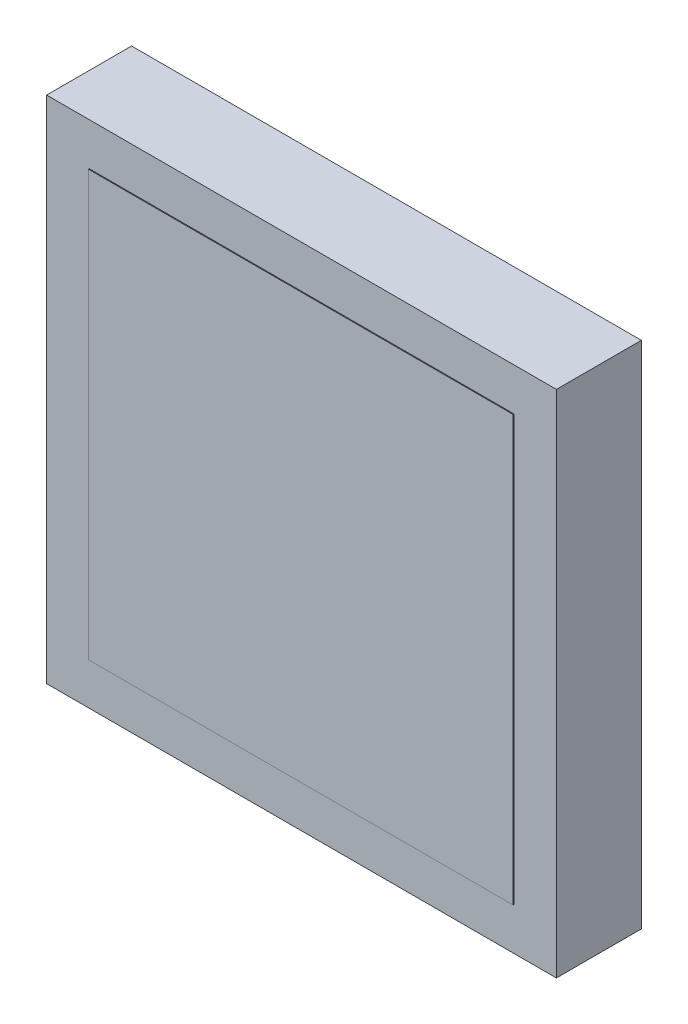
ISO-10303-21;
HEADER;
FILE_DESCRIPTION(('STEP AP214'),'2;1');
FILE_NAME('part.step','',(''),(''),'','','');
FILE_SCHEMA(('AUTOMOTIVE_DESIGN { 1 0 10303 214 1 1 1 1 }'));
ENDSEC;
DATA;
#1=APPLICATION_CONTEXT('core data for automotive mechanical design processes');
#2=APPLICATION_PROTOCOL_DEFINITION('international standard','automotive_design',2000,#1);
#3=PRODUCT_CONTEXT('',#1,'mechanical');
#4=PRODUCT('Part','Part','',(#3));
#5=PRODUCT_RELATED_PRODUCT_CATEGORY('part','',(#4));
#6=PRODUCT_DEFINITION_FORMATION('','',#4);
#7=PRODUCT_DEFINITION_CONTEXT('part definition',#1,'design');
#8=PRODUCT_DEFINITION('design','',#6,#7);
#9=PRODUCT_DEFINITION_SHAPE('','',#8);
#10=(LENGTH_UNIT() NAMED_UNIT(*) SI_UNIT(.MILLI.,.METRE.));
#11=(NAMED_UNIT(*) PLANE_ANGLE_UNIT() SI_UNIT($,.RADIAN.));
#12=(NAMED_UNIT(*) SI_UNIT($,.STERADIAN.) SOLID_ANGLE_UNIT());
#13=UNCERTAINTY_MEASURE_WITH_UNIT(LENGTH_MEASURE(1.E-05),#10,'distance_accuracy_value','');
#14=(GEOMETRIC_REPRESENTATION_CONTEXT(3) GLOBAL_UNCERTAINTY_ASSIGNED_CONTEXT((#13)) GLOBAL_UNIT_ASSIGNED_CONTEXT((#10,
#11,#12)) REPRESENTATION_CONTEXT('',''));
#15=CARTESIAN_POINT('',(0.,0.,0.));
#16=DIRECTION('',(0.,0.,1.));
#17=DIRECTION('',(1.,0.,0.));
#18=AXIS2_PLACEMENT_3D('',#15,#16,#17);
#19=CARTESIAN_POINT('',(0.,0.,10.));
#20=DIRECTION('',(0.,0.,-1.));
#21=DIRECTION('',(-1.,0.,0.));
#22=AXIS2_PLACEMENT_3D('',#19,#20,#21);
#23=PLANE('',#22);
#24=DIRECTION('',(0.,1.,0.));
#25=VECTOR('',#24,1.);
#26=CARTESIAN_POINT('',(30.,-30.,10.));
#27=LINE('',#26,#25);
#28=CARTESIAN_POINT('',(30.,-30.,10.));
#29=VERTEX_POINT('',#28);
#30=CARTESIAN_POINT('',(30.,30.,10.));
#31=VERTEX_POINT('',#30);
#32=EDGE_CURVE('E127',#29,#31,#27,.T.);
#33=ORIENTED_EDGE('',*,*,#32,.T.);
#34=DIRECTION('',(-1.,0.,0.));
#35=VECTOR('',#34,1.);
#36=CARTESIAN_POINT('',(-30.,30.,10.));
#37=LINE('',#36,#35);
#38=CARTESIAN_POINT('',(-30.,30.,10.));
#39=VERTEX_POINT('',#38);
#40=EDGE_CURVE('E130',#31,#39,#37,.T.);
#41=ORIENTED_EDGE('',*,*,#40,.T.);
#42=DIRECTION('',(0.,-1.,0.));
#43=VECTOR('',#42,1.);
#44=CARTESIAN_POINT('',(-30.,-30.,10.));
#45=LINE('',#44,#43);
#46=CARTESIAN_POINT('',(-30.,-30.,10.));
#47=VERTEX_POINT('',#46);
#48=EDGE_CURVE('E133',#39,#47,#45,.T.);
#49=ORIENTED_EDGE('',*,*,#48,.T.);
#50=DIRECTION('',(1.,0.,0.));
#51=VECTOR('',#50,1.);
#52=CARTESIAN_POINT('',(-30.,-30.,10.));
#53=LINE('',#52,#51);
#54=EDGE_CURVE('E135',#47,#29,#53,.T.);
#55=ORIENTED_EDGE('',*,*,#54,.T.);
#56=EDGE_LOOP('',(#33,#41,#49,#55));
#57=FACE_BOUND('',#56,.T.);
#58=DIRECTION('',(0.,1.,0.));
#59=VECTOR('',#58,1.);
#60=CARTESIAN_POINT('',(25.,-25.,10.));
#61=LINE('',#60,#59);
#62=CARTESIAN_POINT('',(25.,-25.,10.));
#63=VERTEX_POINT('',#62);
#64=CARTESIAN_POINT('',(25.,25.,10.));
#65=VERTEX_POINT('',#64);
#66=EDGE_CURVE('E48',#63,#65,#61,.T.);
#67=ORIENTED_EDGE('',*,*,#66,.F.);
#68=DIRECTION('',(1.,0.,0.));
#69=VECTOR('',#68,1.);
#70=CARTESIAN_POINT('',(-25.,-25.,10.));
#71=LINE('',#70,#69);
#72=CARTESIAN_POINT('',(-25.,-25.,10.));
#73=VERTEX_POINT('',#72);
#74=EDGE_CURVE('E52',#73,#63,#71,.T.);
#75=ORIENTED_EDGE('',*,*,#74,.F.);
#76=DIRECTION('',(0.,-1.,0.));
#77=VECTOR('',#76,1.);
#78=CARTESIAN_POINT('',(-25.,-25.,10.));
#79=LINE('',#78,#77);
#80=CARTESIAN_POINT('',(-25.,25.,10.));
#81=VERTEX_POINT('',#80);
#82=EDGE_CURVE('E260',#81,#73,#79,.T.);
#83=ORIENTED_EDGE('',*,*,#82,.F.);
#84=DIRECTION('',(-1.,0.,0.));
#85=VECTOR('',#84,1.);
#86=CARTESIAN_POINT('',(-25.,25.,10.));
#87=LINE('',#86,#85);
#88=EDGE_CURVE('E266',#65,#81,#87,.T.);
#89=ORIENTED_EDGE('',*,*,#88,.F.);
#90=EDGE_LOOP('',(#67,#75,#83,#89));
#91=FACE_BOUND('',#90,.T.);
#92=ADVANCED_FACE('F33',(#57,#91),#23,.F.);
#93=CARTESIAN_POINT('',(30.,-30.,10.));
#94=DIRECTION('',(-1.,0.,0.));
#95=DIRECTION('',(0.,0.,1.));
#96=AXIS2_PLACEMENT_3D('',#93,#94,#95);
#97=PLANE('',#96);
#98=DIRECTION('',(0.,1.,0.));
#99=VECTOR('',#98,1.);
#100=CARTESIAN_POINT('',(30.,-30.,0.));
#101=LINE('',#100,#99);
#102=CARTESIAN_POINT('',(30.,-30.,0.));
#103=VERTEX_POINT('',#102);
#104=CARTESIAN_POINT('',(30.,30.,0.));
#105=VERTEX_POINT('',#104);
#106=EDGE_CURVE('E118',#103,#105,#101,.T.);
#107=ORIENTED_EDGE('',*,*,#106,.T.);
#108=DIRECTION('',(0.,0.,-1.));
#109=VECTOR('',#108,1.);
#110=CARTESIAN_POINT('',(30.,30.,10.));
#111=LINE('',#110,#109);
#112=EDGE_CURVE('E11',#31,#105,#111,.T.);
#113=ORIENTED_EDGE('',*,*,#112,.F.);
#114=ORIENTED_EDGE('',*,*,#32,.F.);
#115=DIRECTION('',(0.,0.,-1.));
#116=VECTOR('',#115,1.);
#117=CARTESIAN_POINT('',(30.,-30.,10.));
#118=LINE('',#117,#116);
#119=EDGE_CURVE('E136',#29,#103,#118,.T.);
#120=ORIENTED_EDGE('',*,*,#119,.T.);
#121=EDGE_LOOP('',(#107,#113,#114,#120));
#122=FACE_BOUND('',#121,.T.);
#123=ADVANCED_FACE('F35',(#122),#97,.F.);
#124=CARTESIAN_POINT('',(-30.,30.,10.));
#125=DIRECTION('',(0.,-1.,0.));
#126=DIRECTION('',(0.,0.,-1.));
#127=AXIS2_PLACEMENT_3D('',#124,#125,#126);
#128=PLANE('',#127);
#129=DIRECTION('',(-1.,0.,0.));
#130=VECTOR('',#129,1.);
#131=CARTESIAN_POINT('',(-30.,30.,0.));
#132=LINE('',#131,#130);
#133=CARTESIAN_POINT('',(-30.,30.,0.));
#134=VERTEX_POINT('',#133);
#135=EDGE_CURVE('E121',#105,#134,#132,.T.);
#136=ORIENTED_EDGE('',*,*,#135,.T.);
#137=DIRECTION('',(0.,0.,-1.));
#138=VECTOR('',#137,1.);
#139=CARTESIAN_POINT('',(-30.,30.,10.));
#140=LINE('',#139,#138);
#141=EDGE_CURVE('E41',#39,#134,#140,.T.);
#142=ORIENTED_EDGE('',*,*,#141,.F.);
#143=ORIENTED_EDGE('',*,*,#40,.F.);
#144=ORIENTED_EDGE('',*,*,#112,.T.);
#145=EDGE_LOOP('',(#136,#142,#143,#144));
#146=FACE_BOUND('',#145,.T.);
#147=ADVANCED_FACE('F166',(#146),#128,.F.);
#148=CARTESIAN_POINT('',(-30.,-30.,10.));
#149=DIRECTION('',(1.,0.,0.));
#150=DIRECTION('',(0.,0.,-1.));
#151=AXIS2_PLACEMENT_3D('',#148,#149,#150);
#152=PLANE('',#151);
#153=DIRECTION('',(0.,-1.,0.));
#154=VECTOR('',#153,1.);
#155=CARTESIAN_POINT('',(-30.,-30.,0.));
#156=LINE('',#155,#154);
#157=CARTESIAN_POINT('',(-30.,-30.,0.));
#158=VERTEX_POINT('',#157);
#159=EDGE_CURVE('E139',#134,#158,#156,.T.);
#160=ORIENTED_EDGE('',*,*,#159,.T.);
#161=DIRECTION('',(0.,0.,-1.));
#162=VECTOR('',#161,1.);
#163=CARTESIAN_POINT('',(-30.,-30.,10.));
#164=LINE('',#163,#162);
#165=EDGE_CURVE('E144',#47,#158,#164,.T.);
#166=ORIENTED_EDGE('',*,*,#165,.F.);
#167=ORIENTED_EDGE('',*,*,#48,.F.);
#168=ORIENTED_EDGE('',*,*,#141,.T.);
#169=EDGE_LOOP('',(#160,#166,#167,#168));
#170=FACE_BOUND('',#169,.T.);
#171=ADVANCED_FACE('F151',(#170),#152,.F.);
#172=CARTESIAN_POINT('',(-30.,-30.,10.));
#173=DIRECTION('',(0.,1.,0.));
#174=DIRECTION('',(0.,0.,1.));
#175=AXIS2_PLACEMENT_3D('',#172,#173,#174);
#176=PLANE('',#175);
#177=DIRECTION('',(1.,0.,0.));
#178=VECTOR('',#177,1.);
#179=CARTESIAN_POINT('',(-30.,-30.,0.));
#180=LINE('',#179,#178);
#181=EDGE_CURVE('E131',#158,#103,#180,.T.);
#182=ORIENTED_EDGE('',*,*,#181,.T.);
#183=ORIENTED_EDGE('',*,*,#119,.F.);
#184=ORIENTED_EDGE('',*,*,#54,.F.);
#185=ORIENTED_EDGE('',*,*,#165,.T.);
#186=EDGE_LOOP('',(#182,#183,#184,#185));
#187=FACE_BOUND('',#186,.T.);
#188=ADVANCED_FACE('F160',(#187),#176,.F.);
#189=CARTESIAN_POINT('',(0.,0.,0.));
#190=DIRECTION('',(0.,0.,-1.));
#191=DIRECTION('',(-1.,0.,0.));
#192=AXIS2_PLACEMENT_3D('',#189,#190,#191);
#193=PLANE('',#192);
#194=ORIENTED_EDGE('',*,*,#106,.F.);
#195=ORIENTED_EDGE('',*,*,#181,.F.);
#196=ORIENTED_EDGE('',*,*,#159,.F.);
#197=ORIENTED_EDGE('',*,*,#135,.F.);
#198=EDGE_LOOP('',(#194,#195,#196,#197));
#199=FACE_BOUND('',#198,.T.);
#200=ADVANCED_FACE('F157',(#199),#193,.T.);
#201=CARTESIAN_POINT('',(25.,-25.,10.1));
#202=DIRECTION('',(-1.,0.,0.));
#203=DIRECTION('',(0.,0.,1.));
#204=AXIS2_PLACEMENT_3D('',#201,#202,#203);
#205=PLANE('',#204);
#206=ORIENTED_EDGE('',*,*,#66,.T.);
#207=DIRECTION('',(0.,0.,-1.));
#208=VECTOR('',#207,1.);
#209=CARTESIAN_POINT('',(25.,25.,10.1));
#210=LINE('',#209,#208);
#211=CARTESIAN_POINT('',(25.,25.,10.1));
#212=VERTEX_POINT('',#211);
#213=EDGE_CURVE('E101',#212,#65,#210,.T.);
#214=ORIENTED_EDGE('',*,*,#213,.F.);
#215=DIRECTION('',(0.,1.,0.));
#216=VECTOR('',#215,1.);
#217=CARTESIAN_POINT('',(25.,-25.,10.1));
#218=LINE('',#217,#216);
#219=CARTESIAN_POINT('',(25.,-25.,10.1));
#220=VERTEX_POINT('',#219);
#221=EDGE_CURVE('E107',#220,#212,#218,.T.);
#222=ORIENTED_EDGE('',*,*,#221,.F.);
#223=DIRECTION('',(0.,0.,-1.));
#224=VECTOR('',#223,1.);
#225=CARTESIAN_POINT('',(25.,-25.,10.1));
#226=LINE('',#225,#224);
#227=EDGE_CURVE('E258',#220,#63,#226,.T.);
#228=ORIENTED_EDGE('',*,*,#227,.T.);
#229=EDGE_LOOP('',(#206,#214,#222,#228));
#230=FACE_BOUND('',#229,.T.);
#231=ADVANCED_FACE('F117',(#230),#205,.F.);
#232=CARTESIAN_POINT('',(-25.,25.,10.1));
#233=DIRECTION('',(0.,-1.,0.));
#234=DIRECTION('',(0.,0.,-1.));
#235=AXIS2_PLACEMENT_3D('',#232,#233,#234);
#236=PLANE('',#235);
#237=ORIENTED_EDGE('',*,*,#88,.T.);
#238=DIRECTION('',(0.,0.,-1.));
#239=VECTOR('',#238,1.);
#240=CARTESIAN_POINT('',(-25.,25.,10.1));
#241=LINE('',#240,#239);
#242=CARTESIAN_POINT('',(-25.,25.,10.1));
#243=VERTEX_POINT('',#242);
#244=EDGE_CURVE('E103',#243,#81,#241,.T.);
#245=ORIENTED_EDGE('',*,*,#244,.F.);
#246=DIRECTION('',(-1.,0.,0.));
#247=VECTOR('',#246,1.);
#248=CARTESIAN_POINT('',(-25.,25.,10.1));
#249=LINE('',#248,#247);
#250=EDGE_CURVE('E96',#212,#243,#249,.T.);
#251=ORIENTED_EDGE('',*,*,#250,.F.);
#252=ORIENTED_EDGE('',*,*,#213,.T.);
#253=EDGE_LOOP('',(#237,#245,#251,#252));
#254=FACE_BOUND('',#253,.T.);
#255=ADVANCED_FACE('F99',(#254),#236,.F.);
#256=CARTESIAN_POINT('',(-25.,-25.,10.1));
#257=DIRECTION('',(1.,0.,0.));
#258=DIRECTION('',(0.,0.,-1.));
#259=AXIS2_PLACEMENT_3D('',#256,#257,#258);
#260=PLANE('',#259);
#261=ORIENTED_EDGE('',*,*,#82,.T.);
#262=DIRECTION('',(0.,0.,-1.));
#263=VECTOR('',#262,1.);
#264=CARTESIAN_POINT('',(-25.,-25.,10.1));
#265=LINE('',#264,#263);
#266=CARTESIAN_POINT('',(-25.,-25.,10.1));
#267=VERTEX_POINT('',#266);
#268=EDGE_CURVE('E123',#267,#73,#265,.T.);
#269=ORIENTED_EDGE('',*,*,#268,.F.);
#270=DIRECTION('',(0.,-1.,0.));
#271=VECTOR('',#270,1.);
#272=CARTESIAN_POINT('',(-25.,-25.,10.1));
#273=LINE('',#272,#271);
#274=EDGE_CURVE('E106',#243,#267,#273,.T.);
#275=ORIENTED_EDGE('',*,*,#274,.F.);
#276=ORIENTED_EDGE('',*,*,#244,.T.);
#277=EDGE_LOOP('',(#261,#269,#275,#276));
#278=FACE_BOUND('',#277,.T.);
#279=ADVANCED_FACE('F202',(#278),#260,.F.);
#280=CARTESIAN_POINT('',(-25.,-25.,10.1));
#281=DIRECTION('',(0.,1.,0.));
#282=DIRECTION('',(0.,0.,1.));
#283=AXIS2_PLACEMENT_3D('',#280,#281,#282);
#284=PLANE('',#283);
#285=ORIENTED_EDGE('',*,*,#74,.T.);
#286=ORIENTED_EDGE('',*,*,#227,.F.);
#287=DIRECTION('',(1.,0.,0.));
#288=VECTOR('',#287,1.);
#289=CARTESIAN_POINT('',(-25.,-25.,10.1));
#290=LINE('',#289,#288);
#291=EDGE_CURVE('E112',#267,#220,#290,.T.);
#292=ORIENTED_EDGE('',*,*,#291,.F.);
#293=ORIENTED_EDGE('',*,*,#268,.T.);
#294=EDGE_LOOP('',(#285,#286,#292,#293));
#295=FACE_BOUND('',#294,.T.);
#296=ADVANCED_FACE('F208',(#295),#284,.F.);
#297=CARTESIAN_POINT('',(0.,0.,10.1));
#298=DIRECTION('',(0.,0.,-1.));
#299=DIRECTION('',(-1.,0.,0.));
#300=AXIS2_PLACEMENT_3D('',#297,#298,#299);
#301=PLANE('',#300);
#302=ORIENTED_EDGE('',*,*,#221,.T.);
#303=ORIENTED_EDGE('',*,*,#250,.T.);
#304=ORIENTED_EDGE('',*,*,#274,.T.);
#305=ORIENTED_EDGE('',*,*,#291,.T.);
#306=EDGE_LOOP('',(#302,#303,#304,#305));
#307=FACE_BOUND('',#306,.T.);
#308=ADVANCED_FACE('F110',(#307),#301,.F.);
#309=CLOSED_SHELL('',(#92,#123,#147,#171,#188,#200,#231,#255,#279,#296,#308));
#310=MANIFOLD_SOLID_BREP('B2',#309);
#311=ADVANCED_BREP_SHAPE_REPRESENTATION('',(#18,#310),#14);
#312=SHAPE_DEFINITION_REPRESENTATION(#9,#311);
ENDSEC;
END-ISO-10303-21;
